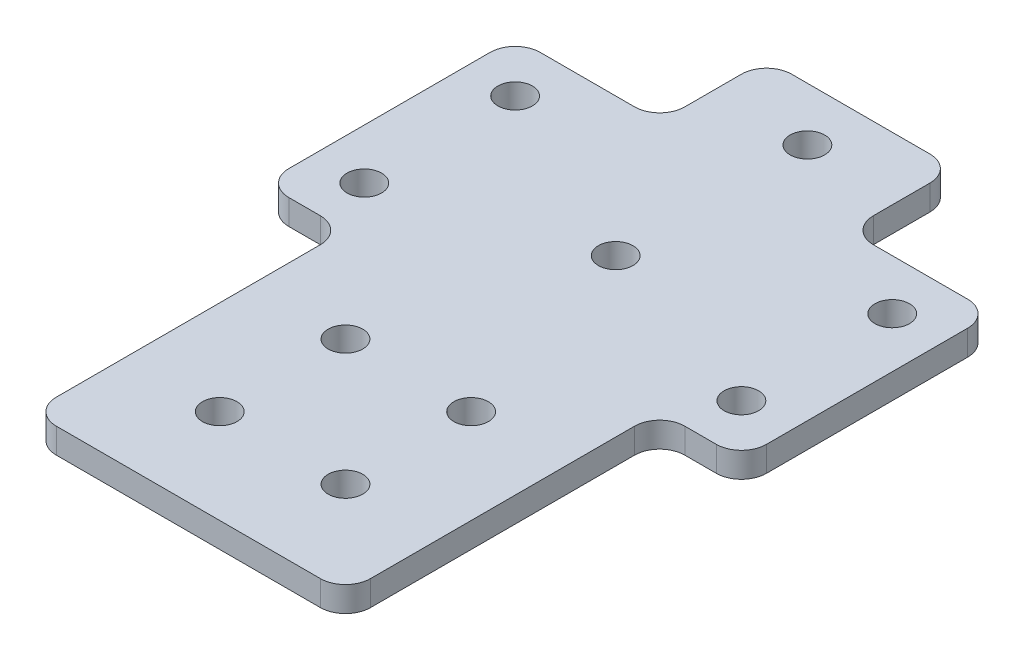
ISO-10303-21;
HEADER;
FILE_DESCRIPTION(('STEP AP214'),'2;1');
FILE_NAME('part.step','',(''),(''),'','','');
FILE_SCHEMA(('AUTOMOTIVE_DESIGN { 1 0 10303 214 1 1 1 1 }'));
ENDSEC;
DATA;
#1=APPLICATION_CONTEXT('core data for automotive mechanical design processes');
#2=APPLICATION_PROTOCOL_DEFINITION('international standard','automotive_design',2000,#1);
#3=PRODUCT_CONTEXT('',#1,'mechanical');
#4=PRODUCT('Part','Part','',(#3));
#5=PRODUCT_RELATED_PRODUCT_CATEGORY('part','',(#4));
#6=PRODUCT_DEFINITION_FORMATION('','',#4);
#7=PRODUCT_DEFINITION_CONTEXT('part definition',#1,'design');
#8=PRODUCT_DEFINITION('design','',#6,#7);
#9=PRODUCT_DEFINITION_SHAPE('','',#8);
#10=(LENGTH_UNIT() NAMED_UNIT(*) SI_UNIT(.MILLI.,.METRE.));
#11=(NAMED_UNIT(*) PLANE_ANGLE_UNIT() SI_UNIT($,.RADIAN.));
#12=(NAMED_UNIT(*) SI_UNIT($,.STERADIAN.) SOLID_ANGLE_UNIT());
#13=UNCERTAINTY_MEASURE_WITH_UNIT(LENGTH_MEASURE(1.E-05),#10,'distance_accuracy_value','');
#14=(GEOMETRIC_REPRESENTATION_CONTEXT(3) GLOBAL_UNCERTAINTY_ASSIGNED_CONTEXT((#13)) GLOBAL_UNIT_ASSIGNED_CONTEXT((#10,
#11,#12)) REPRESENTATION_CONTEXT('',''));
#15=CARTESIAN_POINT('',(0.,0.,0.));
#16=DIRECTION('',(0.,0.,1.));
#17=DIRECTION('',(1.,0.,0.));
#18=AXIS2_PLACEMENT_3D('',#15,#16,#17);
#19=CARTESIAN_POINT('',(-38.,4.,-15.));
#20=DIRECTION('',(0.,0.,1.));
#21=DIRECTION('',(1.,0.,0.));
#22=AXIS2_PLACEMENT_3D('',#19,#20,#21);
#23=PLANE('',#22);
#24=DIRECTION('',(-1.,0.,0.));
#25=VECTOR('',#24,1.);
#26=CARTESIAN_POINT('',(-38.,4.,-15.));
#27=LINE('',#26,#25);
#28=CARTESIAN_POINT('',(-19.,4.,-15.));
#29=VERTEX_POINT('',#28);
#30=CARTESIAN_POINT('',(-34.,4.,-15.));
#31=VERTEX_POINT('',#30);
#32=EDGE_CURVE('E294',#29,#31,#27,.T.);
#33=ORIENTED_EDGE('',*,*,#32,.F.);
#34=DIRECTION('',(0.,1.,0.));
#35=VECTOR('',#34,1.);
#36=CARTESIAN_POINT('',(-19.,4.,-15.));
#37=LINE('',#36,#35);
#38=CARTESIAN_POINT('',(-19.,0.,-15.));
#39=VERTEX_POINT('',#38);
#40=EDGE_CURVE('E329',#29,#39,#37,.F.);
#41=ORIENTED_EDGE('',*,*,#40,.T.);
#42=DIRECTION('',(-1.,0.,0.));
#43=VECTOR('',#42,1.);
#44=CARTESIAN_POINT('',(-38.,0.,-15.));
#45=LINE('',#44,#43);
#46=CARTESIAN_POINT('',(-34.,0.,-15.));
#47=VERTEX_POINT('',#46);
#48=EDGE_CURVE('E224',#39,#47,#45,.T.);
#49=ORIENTED_EDGE('',*,*,#48,.T.);
#50=DIRECTION('',(0.,-1.,0.));
#51=VECTOR('',#50,1.);
#52=CARTESIAN_POINT('',(-34.,4.,-15.));
#53=LINE('',#52,#51);
#54=EDGE_CURVE('E327',#47,#31,#53,.F.);
#55=ORIENTED_EDGE('',*,*,#54,.T.);
#56=EDGE_LOOP('',(#33,#41,#49,#55));
#57=FACE_BOUND('',#56,.T.);
#58=ADVANCED_FACE('F32',(#57),#23,.F.);
#59=CARTESIAN_POINT('',(-38.,4.,25.));
#60=DIRECTION('',(0.,0.,-1.));
#61=DIRECTION('',(-1.,0.,0.));
#62=AXIS2_PLACEMENT_3D('',#59,#60,#61);
#63=PLANE('',#62);
#64=DIRECTION('',(1.,0.,0.));
#65=VECTOR('',#64,1.);
#66=CARTESIAN_POINT('',(-38.,4.,25.));
#67=LINE('',#66,#65);
#68=CARTESIAN_POINT('',(29.,4.,25.));
#69=VERTEX_POINT('',#68);
#70=CARTESIAN_POINT('',(34.,4.,25.));
#71=VERTEX_POINT('',#70);
#72=EDGE_CURVE('E227',#69,#71,#67,.T.);
#73=ORIENTED_EDGE('',*,*,#72,.F.);
#74=DIRECTION('',(0.,1.,0.));
#75=VECTOR('',#74,1.);
#76=CARTESIAN_POINT('',(29.,4.,25.));
#77=LINE('',#76,#75);
#78=CARTESIAN_POINT('',(29.,0.,25.));
#79=VERTEX_POINT('',#78);
#80=EDGE_CURVE('E348',#69,#79,#77,.F.);
#81=ORIENTED_EDGE('',*,*,#80,.T.);
#82=DIRECTION('',(1.,0.,0.));
#83=VECTOR('',#82,1.);
#84=CARTESIAN_POINT('',(-38.,0.,25.));
#85=LINE('',#84,#83);
#86=CARTESIAN_POINT('',(34.,0.,25.));
#87=VERTEX_POINT('',#86);
#88=EDGE_CURVE('E254',#79,#87,#85,.T.);
#89=ORIENTED_EDGE('',*,*,#88,.T.);
#90=DIRECTION('',(0.,-1.,0.));
#91=VECTOR('',#90,1.);
#92=CARTESIAN_POINT('',(34.,4.,25.));
#93=LINE('',#92,#91);
#94=EDGE_CURVE('E346',#87,#71,#93,.F.);
#95=ORIENTED_EDGE('',*,*,#94,.T.);
#96=EDGE_LOOP('',(#73,#81,#89,#95));
#97=FACE_BOUND('',#96,.T.);
#98=ADVANCED_FACE('F481',(#97),#63,.F.);
#99=CARTESIAN_POINT('',(0.,4.,0.));
#100=DIRECTION('',(0.,1.,0.));
#101=DIRECTION('',(0.,0.,1.));
#102=AXIS2_PLACEMENT_3D('',#99,#100,#101);
#103=PLANE('',#102);
#104=CARTESIAN_POINT('',(10.,4.,60.));
#105=DIRECTION('',(0.,1.,0.));
#106=DIRECTION('',(0.,0.,1.));
#107=AXIS2_PLACEMENT_3D('',#104,#105,#106);
#108=CIRCLE('',#107,2.75);
#109=CARTESIAN_POINT('',(10.,4.,62.75));
#110=VERTEX_POINT('',#109);
#111=EDGE_CURVE('E848',#110,#110,#108,.T.);
#112=ORIENTED_EDGE('',*,*,#111,.F.);
#113=EDGE_LOOP('',(#112));
#114=FACE_BOUND('',#113,.T.);
#115=CARTESIAN_POINT('',(-9.99999999999999,4.,60.));
#116=DIRECTION('',(0.,1.,0.));
#117=DIRECTION('',(0.,0.,1.));
#118=AXIS2_PLACEMENT_3D('',#115,#116,#117);
#119=CIRCLE('',#118,2.75);
#120=CARTESIAN_POINT('',(-9.99999999999999,4.,62.75));
#121=VERTEX_POINT('',#120);
#122=EDGE_CURVE('E842',#121,#121,#119,.T.);
#123=ORIENTED_EDGE('',*,*,#122,.F.);
#124=EDGE_LOOP('',(#123));
#125=FACE_BOUND('',#124,.T.);
#126=CARTESIAN_POINT('',(10.,4.,40.));
#127=DIRECTION('',(0.,1.,0.));
#128=DIRECTION('',(0.,0.,1.));
#129=AXIS2_PLACEMENT_3D('',#126,#127,#128);
#130=CIRCLE('',#129,2.75);
#131=CARTESIAN_POINT('',(10.,4.,42.75));
#132=VERTEX_POINT('',#131);
#133=EDGE_CURVE('E836',#132,#132,#130,.T.);
#134=ORIENTED_EDGE('',*,*,#133,.F.);
#135=EDGE_LOOP('',(#134));
#136=FACE_BOUND('',#135,.T.);
#137=CARTESIAN_POINT('',(-9.99999999999999,4.,40.));
#138=DIRECTION('',(0.,1.,0.));
#139=DIRECTION('',(0.,0.,1.));
#140=AXIS2_PLACEMENT_3D('',#137,#138,#139);
#141=CIRCLE('',#140,2.75);
#142=CARTESIAN_POINT('',(-9.99999999999999,4.,42.75));
#143=VERTEX_POINT('',#142);
#144=EDGE_CURVE('E830',#143,#143,#141,.T.);
#145=ORIENTED_EDGE('',*,*,#144,.F.);
#146=EDGE_LOOP('',(#145));
#147=FACE_BOUND('',#146,.T.);
#148=CARTESIAN_POINT('',(0.,4.,7.));
#149=DIRECTION('',(0.,1.,0.));
#150=DIRECTION('',(0.,0.,1.));
#151=AXIS2_PLACEMENT_3D('',#148,#149,#150);
#152=CIRCLE('',#151,2.75);
#153=CARTESIAN_POINT('',(0.,4.,9.75));
#154=VERTEX_POINT('',#153);
#155=EDGE_CURVE('E824',#154,#154,#152,.T.);
#156=ORIENTED_EDGE('',*,*,#155,.F.);
#157=EDGE_LOOP('',(#156));
#158=FACE_BOUND('',#157,.T.);
#159=CARTESIAN_POINT('',(0.,4.,-23.5));
#160=DIRECTION('',(0.,1.,0.));
#161=DIRECTION('',(0.,0.,1.));
#162=AXIS2_PLACEMENT_3D('',#159,#160,#161);
#163=CIRCLE('',#162,2.75);
#164=CARTESIAN_POINT('',(0.,4.,-20.75));
#165=VERTEX_POINT('',#164);
#166=EDGE_CURVE('E819',#165,#165,#163,.T.);
#167=ORIENTED_EDGE('',*,*,#166,.F.);
#168=EDGE_LOOP('',(#167));
#169=FACE_BOUND('',#168,.T.);
#170=CARTESIAN_POINT('',(-30.,4.,17.));
#171=DIRECTION('',(0.,1.,0.));
#172=DIRECTION('',(0.,0.,1.));
#173=AXIS2_PLACEMENT_3D('',#170,#171,#172);
#174=CIRCLE('',#173,2.75);
#175=CARTESIAN_POINT('',(-30.,4.,19.75));
#176=VERTEX_POINT('',#175);
#177=EDGE_CURVE('E448',#176,#176,#174,.T.);
#178=ORIENTED_EDGE('',*,*,#177,.F.);
#179=EDGE_LOOP('',(#178));
#180=FACE_BOUND('',#179,.T.);
#181=CARTESIAN_POINT('',(-30.,4.,-7.));
#182=DIRECTION('',(0.,1.,0.));
#183=DIRECTION('',(0.,0.,1.));
#184=AXIS2_PLACEMENT_3D('',#181,#182,#183);
#185=CIRCLE('',#184,2.75);
#186=CARTESIAN_POINT('',(-30.,4.,-4.25));
#187=VERTEX_POINT('',#186);
#188=EDGE_CURVE('E303',#187,#187,#185,.T.);
#189=ORIENTED_EDGE('',*,*,#188,.F.);
#190=EDGE_LOOP('',(#189));
#191=FACE_BOUND('',#190,.T.);
#192=DIRECTION('',(0.,0.,-1.));
#193=VECTOR('',#192,1.);
#194=CARTESIAN_POINT('',(15.,4.,-15.));
#195=LINE('',#194,#193);
#196=CARTESIAN_POINT('',(15.,4.,-19.));
#197=VERTEX_POINT('',#196);
#198=CARTESIAN_POINT('',(15.,4.,-28.));
#199=VERTEX_POINT('',#198);
#200=EDGE_CURVE('E267',#197,#199,#195,.T.);
#201=ORIENTED_EDGE('',*,*,#200,.T.);
#202=CARTESIAN_POINT('',(11.,4.,-28.));
#203=DIRECTION('',(0.,1.,0.));
#204=DIRECTION('',(0.,0.,1.));
#205=AXIS2_PLACEMENT_3D('',#202,#203,#204);
#206=CIRCLE('',#205,4.);
#207=CARTESIAN_POINT('',(11.,4.,-32.));
#208=VERTEX_POINT('',#207);
#209=EDGE_CURVE('E411',#199,#208,#206,.T.);
#210=ORIENTED_EDGE('',*,*,#209,.T.);
#211=DIRECTION('',(-1.,0.,0.));
#212=VECTOR('',#211,1.);
#213=CARTESIAN_POINT('',(-15.,4.,-32.));
#214=LINE('',#213,#212);
#215=CARTESIAN_POINT('',(-11.,4.,-32.));
#216=VERTEX_POINT('',#215);
#217=EDGE_CURVE('E253',#208,#216,#214,.T.);
#218=ORIENTED_EDGE('',*,*,#217,.T.);
#219=CARTESIAN_POINT('',(-11.,4.,-28.));
#220=DIRECTION('',(0.,1.,0.));
#221=DIRECTION('',(0.,0.,1.));
#222=AXIS2_PLACEMENT_3D('',#219,#220,#221);
#223=CIRCLE('',#222,4.);
#224=CARTESIAN_POINT('',(-15.,4.,-28.));
#225=VERTEX_POINT('',#224);
#226=EDGE_CURVE('E409',#216,#225,#223,.T.);
#227=ORIENTED_EDGE('',*,*,#226,.T.);
#228=DIRECTION('',(0.,0.,1.));
#229=VECTOR('',#228,1.);
#230=CARTESIAN_POINT('',(-15.,4.,-15.));
#231=LINE('',#230,#229);
#232=CARTESIAN_POINT('',(-15.,4.,-19.));
#233=VERTEX_POINT('',#232);
#234=EDGE_CURVE('E290',#225,#233,#231,.T.);
#235=ORIENTED_EDGE('',*,*,#234,.T.);
#236=CARTESIAN_POINT('',(-19.,4.,-19.));
#237=DIRECTION('',(0.,1.,0.));
#238=DIRECTION('',(0.,0.,1.));
#239=AXIS2_PLACEMENT_3D('',#236,#237,#238);
#240=CIRCLE('',#239,4.);
#241=EDGE_CURVE('E367',#233,#29,#240,.F.);
#242=ORIENTED_EDGE('',*,*,#241,.T.);
#243=ORIENTED_EDGE('',*,*,#32,.T.);
#244=CARTESIAN_POINT('',(-34.,4.,-11.));
#245=DIRECTION('',(0.,1.,0.));
#246=DIRECTION('',(0.,0.,1.));
#247=AXIS2_PLACEMENT_3D('',#244,#245,#246);
#248=CIRCLE('',#247,4.);
#249=CARTESIAN_POINT('',(-38.,4.,-11.));
#250=VERTEX_POINT('',#249);
#251=EDGE_CURVE('E398',#31,#250,#248,.T.);
#252=ORIENTED_EDGE('',*,*,#251,.T.);
#253=DIRECTION('',(0.,0.,1.));
#254=VECTOR('',#253,1.);
#255=CARTESIAN_POINT('',(-38.,4.,-15.));
#256=LINE('',#255,#254);
#257=CARTESIAN_POINT('',(-38.,4.,21.));
#258=VERTEX_POINT('',#257);
#259=EDGE_CURVE('E223',#250,#258,#256,.T.);
#260=ORIENTED_EDGE('',*,*,#259,.T.);
#261=CARTESIAN_POINT('',(-34.,4.,21.));
#262=DIRECTION('',(0.,1.,0.));
#263=DIRECTION('',(0.,0.,1.));
#264=AXIS2_PLACEMENT_3D('',#261,#262,#263);
#265=CIRCLE('',#264,4.);
#266=CARTESIAN_POINT('',(-34.,4.,25.));
#267=VERTEX_POINT('',#266);
#268=EDGE_CURVE('E274',#258,#267,#265,.T.);
#269=ORIENTED_EDGE('',*,*,#268,.T.);
#270=CARTESIAN_POINT('',(-29.,4.,25.));
#271=VERTEX_POINT('',#270);
#272=EDGE_CURVE('E275',#267,#271,#67,.T.);
#273=ORIENTED_EDGE('',*,*,#272,.T.);
#274=CARTESIAN_POINT('',(-29.,4.,29.));
#275=DIRECTION('',(0.,1.,0.));
#276=DIRECTION('',(0.,0.,1.));
#277=AXIS2_PLACEMENT_3D('',#274,#275,#276);
#278=CIRCLE('',#277,4.);
#279=CARTESIAN_POINT('',(-25.,4.,29.));
#280=VERTEX_POINT('',#279);
#281=EDGE_CURVE('E40',#271,#280,#278,.F.);
#282=ORIENTED_EDGE('',*,*,#281,.T.);
#283=DIRECTION('',(0.,0.,1.));
#284=VECTOR('',#283,1.);
#285=CARTESIAN_POINT('',(-25.,4.,25.));
#286=LINE('',#285,#284);
#287=CARTESIAN_POINT('',(-25.,4.,71.));
#288=VERTEX_POINT('',#287);
#289=EDGE_CURVE('E280',#280,#288,#286,.T.);
#290=ORIENTED_EDGE('',*,*,#289,.T.);
#291=CARTESIAN_POINT('',(-21.,4.,71.));
#292=DIRECTION('',(0.,1.,0.));
#293=DIRECTION('',(0.,0.,1.));
#294=AXIS2_PLACEMENT_3D('',#291,#292,#293);
#295=CIRCLE('',#294,4.);
#296=CARTESIAN_POINT('',(-21.,4.,75.));
#297=VERTEX_POINT('',#296);
#298=EDGE_CURVE('E407',#288,#297,#295,.T.);
#299=ORIENTED_EDGE('',*,*,#298,.T.);
#300=DIRECTION('',(1.,0.,0.));
#301=VECTOR('',#300,1.);
#302=CARTESIAN_POINT('',(-25.,4.,75.));
#303=LINE('',#302,#301);
#304=CARTESIAN_POINT('',(21.,4.,75.));
#305=VERTEX_POINT('',#304);
#306=EDGE_CURVE('E388',#297,#305,#303,.T.);
#307=ORIENTED_EDGE('',*,*,#306,.T.);
#308=CARTESIAN_POINT('',(21.,4.,71.));
#309=DIRECTION('',(0.,1.,0.));
#310=DIRECTION('',(0.,0.,1.));
#311=AXIS2_PLACEMENT_3D('',#308,#309,#310);
#312=CIRCLE('',#311,4.);
#313=CARTESIAN_POINT('',(25.,4.,71.));
#314=VERTEX_POINT('',#313);
#315=EDGE_CURVE('E405',#305,#314,#312,.T.);
#316=ORIENTED_EDGE('',*,*,#315,.T.);
#317=DIRECTION('',(0.,0.,-1.));
#318=VECTOR('',#317,1.);
#319=CARTESIAN_POINT('',(25.,4.,25.));
#320=LINE('',#319,#318);
#321=CARTESIAN_POINT('',(25.,4.,29.));
#322=VERTEX_POINT('',#321);
#323=EDGE_CURVE('E289',#314,#322,#320,.T.);
#324=ORIENTED_EDGE('',*,*,#323,.T.);
#325=CARTESIAN_POINT('',(29.,4.,29.));
#326=DIRECTION('',(0.,1.,0.));
#327=DIRECTION('',(0.,0.,1.));
#328=AXIS2_PLACEMENT_3D('',#325,#326,#327);
#329=CIRCLE('',#328,4.);
#330=EDGE_CURVE('E371',#322,#69,#329,.F.);
#331=ORIENTED_EDGE('',*,*,#330,.T.);
#332=ORIENTED_EDGE('',*,*,#72,.T.);
#333=CARTESIAN_POINT('',(34.,4.,21.));
#334=DIRECTION('',(0.,1.,0.));
#335=DIRECTION('',(0.,0.,1.));
#336=AXIS2_PLACEMENT_3D('',#333,#334,#335);
#337=CIRCLE('',#336,4.);
#338=CARTESIAN_POINT('',(38.,4.,21.));
#339=VERTEX_POINT('',#338);
#340=EDGE_CURVE('E401',#71,#339,#337,.T.);
#341=ORIENTED_EDGE('',*,*,#340,.T.);
#342=DIRECTION('',(0.,0.,-1.));
#343=VECTOR('',#342,1.);
#344=CARTESIAN_POINT('',(38.,4.,-15.));
#345=LINE('',#344,#343);
#346=CARTESIAN_POINT('',(38.,4.,-11.));
#347=VERTEX_POINT('',#346);
#348=EDGE_CURVE('E279',#339,#347,#345,.T.);
#349=ORIENTED_EDGE('',*,*,#348,.T.);
#350=CARTESIAN_POINT('',(34.,4.,-11.));
#351=DIRECTION('',(0.,1.,0.));
#352=DIRECTION('',(0.,0.,1.));
#353=AXIS2_PLACEMENT_3D('',#350,#351,#352);
#354=CIRCLE('',#353,4.);
#355=CARTESIAN_POINT('',(34.,4.,-15.));
#356=VERTEX_POINT('',#355);
#357=EDGE_CURVE('E399',#347,#356,#354,.T.);
#358=ORIENTED_EDGE('',*,*,#357,.T.);
#359=CARTESIAN_POINT('',(19.,4.,-15.));
#360=VERTEX_POINT('',#359);
#361=EDGE_CURVE('E214',#356,#360,#27,.T.);
#362=ORIENTED_EDGE('',*,*,#361,.T.);
#363=CARTESIAN_POINT('',(19.,4.,-19.));
#364=DIRECTION('',(0.,1.,0.));
#365=DIRECTION('',(0.,0.,1.));
#366=AXIS2_PLACEMENT_3D('',#363,#364,#365);
#367=CIRCLE('',#366,4.);
#368=EDGE_CURVE('E364',#360,#197,#367,.F.);
#369=ORIENTED_EDGE('',*,*,#368,.T.);
#370=EDGE_LOOP('',(#201,#210,#218,#227,#235,#242,#243,#252,#260,#269,#273,#282,#290,#299,#307,
#316,#324,#331,#332,#341,#349,#358,#362,#369));
#371=FACE_BOUND('',#370,.T.);
#372=CARTESIAN_POINT('',(30.,4.,-7.));
#373=DIRECTION('',(0.,1.,0.));
#374=DIRECTION('',(0.,0.,1.));
#375=AXIS2_PLACEMENT_3D('',#372,#373,#374);
#376=CIRCLE('',#375,2.75);
#377=CARTESIAN_POINT('',(30.,4.,-4.25));
#378=VERTEX_POINT('',#377);
#379=EDGE_CURVE('E454',#378,#378,#376,.T.);
#380=ORIENTED_EDGE('',*,*,#379,.F.);
#381=EDGE_LOOP('',(#380));
#382=FACE_BOUND('',#381,.T.);
#383=CARTESIAN_POINT('',(30.,4.,17.));
#384=DIRECTION('',(0.,1.,0.));
#385=DIRECTION('',(0.,0.,1.));
#386=AXIS2_PLACEMENT_3D('',#383,#384,#385);
#387=CIRCLE('',#386,2.75);
#388=CARTESIAN_POINT('',(30.,4.,19.75));
#389=VERTEX_POINT('',#388);
#390=EDGE_CURVE('E441',#389,#389,#387,.T.);
#391=ORIENTED_EDGE('',*,*,#390,.F.);
#392=EDGE_LOOP('',(#391));
#393=FACE_BOUND('',#392,.T.);
#394=ADVANCED_FACE('F378',(#114,#125,#136,#147,#158,#169,#180,#191,#371,#382,#393),#103,.T.);
#395=CARTESIAN_POINT('',(0.,0.,0.));
#396=DIRECTION('',(0.,1.,0.));
#397=DIRECTION('',(0.,0.,1.));
#398=AXIS2_PLACEMENT_3D('',#395,#396,#397);
#399=PLANE('',#398);
#400=CARTESIAN_POINT('',(10.,0.,60.));
#401=DIRECTION('',(0.,1.,0.));
#402=DIRECTION('',(0.,0.,1.));
#403=AXIS2_PLACEMENT_3D('',#400,#401,#402);
#404=CIRCLE('',#403,2.75);
#405=CARTESIAN_POINT('',(10.,0.,62.75));
#406=VERTEX_POINT('',#405);
#407=EDGE_CURVE('E845',#406,#406,#404,.T.);
#408=ORIENTED_EDGE('',*,*,#407,.T.);
#409=EDGE_LOOP('',(#408));
#410=FACE_BOUND('',#409,.T.);
#411=CARTESIAN_POINT('',(-9.99999999999999,0.,60.));
#412=DIRECTION('',(0.,1.,0.));
#413=DIRECTION('',(0.,0.,1.));
#414=AXIS2_PLACEMENT_3D('',#411,#412,#413);
#415=CIRCLE('',#414,2.75);
#416=CARTESIAN_POINT('',(-9.99999999999999,0.,62.75));
#417=VERTEX_POINT('',#416);
#418=EDGE_CURVE('E839',#417,#417,#415,.T.);
#419=ORIENTED_EDGE('',*,*,#418,.T.);
#420=EDGE_LOOP('',(#419));
#421=FACE_BOUND('',#420,.T.);
#422=CARTESIAN_POINT('',(10.,0.,40.));
#423=DIRECTION('',(0.,1.,0.));
#424=DIRECTION('',(0.,0.,1.));
#425=AXIS2_PLACEMENT_3D('',#422,#423,#424);
#426=CIRCLE('',#425,2.75);
#427=CARTESIAN_POINT('',(10.,0.,42.75));
#428=VERTEX_POINT('',#427);
#429=EDGE_CURVE('E833',#428,#428,#426,.T.);
#430=ORIENTED_EDGE('',*,*,#429,.T.);
#431=EDGE_LOOP('',(#430));
#432=FACE_BOUND('',#431,.T.);
#433=CARTESIAN_POINT('',(-9.99999999999999,0.,40.));
#434=DIRECTION('',(0.,1.,0.));
#435=DIRECTION('',(0.,0.,1.));
#436=AXIS2_PLACEMENT_3D('',#433,#434,#435);
#437=CIRCLE('',#436,2.75);
#438=CARTESIAN_POINT('',(-9.99999999999999,0.,42.75));
#439=VERTEX_POINT('',#438);
#440=EDGE_CURVE('E828',#439,#439,#437,.T.);
#441=ORIENTED_EDGE('',*,*,#440,.T.);
#442=EDGE_LOOP('',(#441));
#443=FACE_BOUND('',#442,.T.);
#444=CARTESIAN_POINT('',(0.,0.,7.));
#445=DIRECTION('',(0.,1.,0.));
#446=DIRECTION('',(0.,0.,1.));
#447=AXIS2_PLACEMENT_3D('',#444,#445,#446);
#448=CIRCLE('',#447,2.75);
#449=CARTESIAN_POINT('',(0.,0.,9.75));
#450=VERTEX_POINT('',#449);
#451=EDGE_CURVE('E821',#450,#450,#448,.T.);
#452=ORIENTED_EDGE('',*,*,#451,.T.);
#453=EDGE_LOOP('',(#452));
#454=FACE_BOUND('',#453,.T.);
#455=CARTESIAN_POINT('',(0.,0.,-23.5));
#456=DIRECTION('',(0.,1.,0.));
#457=DIRECTION('',(0.,0.,1.));
#458=AXIS2_PLACEMENT_3D('',#455,#456,#457);
#459=CIRCLE('',#458,2.75);
#460=CARTESIAN_POINT('',(0.,0.,-20.75));
#461=VERTEX_POINT('',#460);
#462=EDGE_CURVE('E293',#461,#461,#459,.T.);
#463=ORIENTED_EDGE('',*,*,#462,.T.);
#464=EDGE_LOOP('',(#463));
#465=FACE_BOUND('',#464,.T.);
#466=DIRECTION('',(-1.,0.,0.));
#467=VECTOR('',#466,1.);
#468=CARTESIAN_POINT('',(-15.,0.,-32.));
#469=LINE('',#468,#467);
#470=CARTESIAN_POINT('',(11.,0.,-32.));
#471=VERTEX_POINT('',#470);
#472=CARTESIAN_POINT('',(-11.,0.,-32.));
#473=VERTEX_POINT('',#472);
#474=EDGE_CURVE('E266',#471,#473,#469,.T.);
#475=ORIENTED_EDGE('',*,*,#474,.F.);
#476=CARTESIAN_POINT('',(11.,0.,-28.));
#477=DIRECTION('',(0.,1.,0.));
#478=DIRECTION('',(0.,0.,1.));
#479=AXIS2_PLACEMENT_3D('',#476,#477,#478);
#480=CIRCLE('',#479,4.);
#481=CARTESIAN_POINT('',(15.,0.,-28.));
#482=VERTEX_POINT('',#481);
#483=EDGE_CURVE('E320',#471,#482,#480,.F.);
#484=ORIENTED_EDGE('',*,*,#483,.T.);
#485=DIRECTION('',(0.,0.,-1.));
#486=VECTOR('',#485,1.);
#487=CARTESIAN_POINT('',(15.,0.,-15.));
#488=LINE('',#487,#486);
#489=CARTESIAN_POINT('',(15.,0.,-19.));
#490=VERTEX_POINT('',#489);
#491=EDGE_CURVE('E252',#490,#482,#488,.T.);
#492=ORIENTED_EDGE('',*,*,#491,.F.);
#493=CARTESIAN_POINT('',(19.,0.,-19.));
#494=DIRECTION('',(0.,1.,0.));
#495=DIRECTION('',(0.,0.,1.));
#496=AXIS2_PLACEMENT_3D('',#493,#494,#495);
#497=CIRCLE('',#496,4.);
#498=CARTESIAN_POINT('',(19.,0.,-15.));
#499=VERTEX_POINT('',#498);
#500=EDGE_CURVE('E222',#490,#499,#497,.T.);
#501=ORIENTED_EDGE('',*,*,#500,.T.);
#502=CARTESIAN_POINT('',(34.,0.,-15.));
#503=VERTEX_POINT('',#502);
#504=EDGE_CURVE('E211',#503,#499,#45,.T.);
#505=ORIENTED_EDGE('',*,*,#504,.F.);
#506=CARTESIAN_POINT('',(34.,0.,-11.));
#507=DIRECTION('',(0.,1.,0.));
#508=DIRECTION('',(0.,0.,1.));
#509=AXIS2_PLACEMENT_3D('',#506,#507,#508);
#510=CIRCLE('',#509,4.);
#511=CARTESIAN_POINT('',(38.,0.,-11.));
#512=VERTEX_POINT('',#511);
#513=EDGE_CURVE('E194',#503,#512,#510,.F.);
#514=ORIENTED_EDGE('',*,*,#513,.T.);
#515=DIRECTION('',(0.,0.,-1.));
#516=VECTOR('',#515,1.);
#517=CARTESIAN_POINT('',(38.,0.,-15.));
#518=LINE('',#517,#516);
#519=CARTESIAN_POINT('',(38.,0.,21.));
#520=VERTEX_POINT('',#519);
#521=EDGE_CURVE('E230',#520,#512,#518,.T.);
#522=ORIENTED_EDGE('',*,*,#521,.F.);
#523=CARTESIAN_POINT('',(34.,0.,21.));
#524=DIRECTION('',(0.,1.,0.));
#525=DIRECTION('',(0.,0.,1.));
#526=AXIS2_PLACEMENT_3D('',#523,#524,#525);
#527=CIRCLE('',#526,4.);
#528=EDGE_CURVE('E203',#520,#87,#527,.F.);
#529=ORIENTED_EDGE('',*,*,#528,.T.);
#530=ORIENTED_EDGE('',*,*,#88,.F.);
#531=CARTESIAN_POINT('',(29.,0.,29.));
#532=DIRECTION('',(0.,1.,0.));
#533=DIRECTION('',(0.,0.,1.));
#534=AXIS2_PLACEMENT_3D('',#531,#532,#533);
#535=CIRCLE('',#534,4.);
#536=CARTESIAN_POINT('',(25.,0.,29.));
#537=VERTEX_POINT('',#536);
#538=EDGE_CURVE('E373',#79,#537,#535,.T.);
#539=ORIENTED_EDGE('',*,*,#538,.T.);
#540=DIRECTION('',(0.,0.,-1.));
#541=VECTOR('',#540,1.);
#542=CARTESIAN_POINT('',(25.,0.,25.));
#543=LINE('',#542,#541);
#544=CARTESIAN_POINT('',(25.,0.,71.));
#545=VERTEX_POINT('',#544);
#546=EDGE_CURVE('E438',#545,#537,#543,.T.);
#547=ORIENTED_EDGE('',*,*,#546,.F.);
#548=CARTESIAN_POINT('',(21.,0.,71.));
#549=DIRECTION('',(0.,1.,0.));
#550=DIRECTION('',(0.,0.,1.));
#551=AXIS2_PLACEMENT_3D('',#548,#549,#550);
#552=CIRCLE('',#551,4.);
#553=CARTESIAN_POINT('',(21.,0.,75.));
#554=VERTEX_POINT('',#553);
#555=EDGE_CURVE('E314',#545,#554,#552,.F.);
#556=ORIENTED_EDGE('',*,*,#555,.T.);
#557=DIRECTION('',(1.,0.,0.));
#558=VECTOR('',#557,1.);
#559=CARTESIAN_POINT('',(-25.,0.,75.));
#560=LINE('',#559,#558);
#561=CARTESIAN_POINT('',(-21.,0.,75.));
#562=VERTEX_POINT('',#561);
#563=EDGE_CURVE('E435',#562,#554,#560,.T.);
#564=ORIENTED_EDGE('',*,*,#563,.F.);
#565=CARTESIAN_POINT('',(-21.,0.,71.));
#566=DIRECTION('',(0.,1.,0.));
#567=DIRECTION('',(0.,0.,1.));
#568=AXIS2_PLACEMENT_3D('',#565,#566,#567);
#569=CIRCLE('',#568,4.);
#570=CARTESIAN_POINT('',(-25.,0.,71.));
#571=VERTEX_POINT('',#570);
#572=EDGE_CURVE('E316',#562,#571,#569,.F.);
#573=ORIENTED_EDGE('',*,*,#572,.T.);
#574=DIRECTION('',(0.,0.,1.));
#575=VECTOR('',#574,1.);
#576=CARTESIAN_POINT('',(-25.,0.,25.));
#577=LINE('',#576,#575);
#578=CARTESIAN_POINT('',(-25.,0.,29.));
#579=VERTEX_POINT('',#578);
#580=EDGE_CURVE('E310',#579,#571,#577,.T.);
#581=ORIENTED_EDGE('',*,*,#580,.F.);
#582=CARTESIAN_POINT('',(-29.,0.,29.));
#583=DIRECTION('',(0.,1.,0.));
#584=DIRECTION('',(0.,0.,1.));
#585=AXIS2_PLACEMENT_3D('',#582,#583,#584);
#586=CIRCLE('',#585,4.);
#587=CARTESIAN_POINT('',(-29.,0.,25.));
#588=VERTEX_POINT('',#587);
#589=EDGE_CURVE('E11',#579,#588,#586,.T.);
#590=ORIENTED_EDGE('',*,*,#589,.T.);
#591=CARTESIAN_POINT('',(-34.,0.,25.));
#592=VERTEX_POINT('',#591);
#593=EDGE_CURVE('E307',#592,#588,#85,.T.);
#594=ORIENTED_EDGE('',*,*,#593,.F.);
#595=CARTESIAN_POINT('',(-34.,0.,21.));
#596=DIRECTION('',(0.,1.,0.));
#597=DIRECTION('',(0.,0.,1.));
#598=AXIS2_PLACEMENT_3D('',#595,#596,#597);
#599=CIRCLE('',#598,4.);
#600=CARTESIAN_POINT('',(-38.,0.,21.));
#601=VERTEX_POINT('',#600);
#602=EDGE_CURVE('E53',#592,#601,#599,.F.);
#603=ORIENTED_EDGE('',*,*,#602,.T.);
#604=DIRECTION('',(0.,0.,1.));
#605=VECTOR('',#604,1.);
#606=CARTESIAN_POINT('',(-38.,0.,-15.));
#607=LINE('',#606,#605);
#608=CARTESIAN_POINT('',(-38.,0.,-11.));
#609=VERTEX_POINT('',#608);
#610=EDGE_CURVE('E300',#609,#601,#607,.T.);
#611=ORIENTED_EDGE('',*,*,#610,.F.);
#612=CARTESIAN_POINT('',(-34.,0.,-11.));
#613=DIRECTION('',(0.,1.,0.));
#614=DIRECTION('',(0.,0.,1.));
#615=AXIS2_PLACEMENT_3D('',#612,#613,#614);
#616=CIRCLE('',#615,4.);
#617=EDGE_CURVE('E204',#609,#47,#616,.F.);
#618=ORIENTED_EDGE('',*,*,#617,.T.);
#619=ORIENTED_EDGE('',*,*,#48,.F.);
#620=CARTESIAN_POINT('',(-19.,0.,-19.));
#621=DIRECTION('',(0.,1.,0.));
#622=DIRECTION('',(0.,0.,1.));
#623=AXIS2_PLACEMENT_3D('',#620,#621,#622);
#624=CIRCLE('',#623,4.);
#625=CARTESIAN_POINT('',(-15.,0.,-19.));
#626=VERTEX_POINT('',#625);
#627=EDGE_CURVE('E369',#39,#626,#624,.T.);
#628=ORIENTED_EDGE('',*,*,#627,.T.);
#629=DIRECTION('',(0.,0.,1.));
#630=VECTOR('',#629,1.);
#631=CARTESIAN_POINT('',(-15.,0.,-15.));
#632=LINE('',#631,#630);
#633=CARTESIAN_POINT('',(-15.,0.,-28.));
#634=VERTEX_POINT('',#633);
#635=EDGE_CURVE('E249',#634,#626,#632,.T.);
#636=ORIENTED_EDGE('',*,*,#635,.F.);
#637=CARTESIAN_POINT('',(-11.,0.,-28.));
#638=DIRECTION('',(0.,1.,0.));
#639=DIRECTION('',(0.,0.,1.));
#640=AXIS2_PLACEMENT_3D('',#637,#638,#639);
#641=CIRCLE('',#640,4.);
#642=EDGE_CURVE('E318',#634,#473,#641,.F.);
#643=ORIENTED_EDGE('',*,*,#642,.T.);
#644=EDGE_LOOP('',(#475,#484,#492,#501,#505,#514,#522,#529,#530,#539,#547,#556,#564,#573,#581,
#590,#594,#603,#611,#618,#619,#628,#636,#643));
#645=FACE_BOUND('',#644,.T.);
#646=CARTESIAN_POINT('',(-30.,0.,-7.));
#647=DIRECTION('',(0.,1.,0.));
#648=DIRECTION('',(0.,0.,1.));
#649=AXIS2_PLACEMENT_3D('',#646,#647,#648);
#650=CIRCLE('',#649,2.75);
#651=CARTESIAN_POINT('',(-30.,0.,-4.25));
#652=VERTEX_POINT('',#651);
#653=EDGE_CURVE('E457',#652,#652,#650,.T.);
#654=ORIENTED_EDGE('',*,*,#653,.T.);
#655=EDGE_LOOP('',(#654));
#656=FACE_BOUND('',#655,.T.);
#657=CARTESIAN_POINT('',(30.,0.,-7.));
#658=DIRECTION('',(0.,1.,0.));
#659=DIRECTION('',(0.,0.,1.));
#660=AXIS2_PLACEMENT_3D('',#657,#658,#659);
#661=CIRCLE('',#660,2.75);
#662=CARTESIAN_POINT('',(30.,0.,-4.25));
#663=VERTEX_POINT('',#662);
#664=EDGE_CURVE('E451',#663,#663,#661,.T.);
#665=ORIENTED_EDGE('',*,*,#664,.T.);
#666=EDGE_LOOP('',(#665));
#667=FACE_BOUND('',#666,.T.);
#668=CARTESIAN_POINT('',(-30.,0.,17.));
#669=DIRECTION('',(0.,1.,0.));
#670=DIRECTION('',(0.,0.,1.));
#671=AXIS2_PLACEMENT_3D('',#668,#669,#670);
#672=CIRCLE('',#671,2.75);
#673=CARTESIAN_POINT('',(-30.,0.,19.75));
#674=VERTEX_POINT('',#673);
#675=EDGE_CURVE('E444',#674,#674,#672,.T.);
#676=ORIENTED_EDGE('',*,*,#675,.T.);
#677=EDGE_LOOP('',(#676));
#678=FACE_BOUND('',#677,.T.);
#679=CARTESIAN_POINT('',(30.,0.,17.));
#680=DIRECTION('',(0.,1.,0.));
#681=DIRECTION('',(0.,0.,1.));
#682=AXIS2_PLACEMENT_3D('',#679,#680,#681);
#683=CIRCLE('',#682,2.75);
#684=CARTESIAN_POINT('',(30.,0.,19.75));
#685=VERTEX_POINT('',#684);
#686=EDGE_CURVE('E445',#685,#685,#683,.T.);
#687=ORIENTED_EDGE('',*,*,#686,.T.);
#688=EDGE_LOOP('',(#687));
#689=FACE_BOUND('',#688,.T.);
#690=ADVANCED_FACE('F218',(#410,#421,#432,#443,#454,#465,#645,#656,#667,#678,#689),#399,.F.);
#691=CARTESIAN_POINT('',(-38.,4.,-15.));
#692=DIRECTION('',(1.,0.,0.));
#693=DIRECTION('',(0.,0.,-1.));
#694=AXIS2_PLACEMENT_3D('',#691,#692,#693);
#695=PLANE('',#694);
#696=ORIENTED_EDGE('',*,*,#259,.F.);
#697=DIRECTION('',(0.,-1.,0.));
#698=VECTOR('',#697,1.);
#699=CARTESIAN_POINT('',(-38.,4.,-11.));
#700=LINE('',#699,#698);
#701=EDGE_CURVE('E356',#250,#609,#700,.T.);
#702=ORIENTED_EDGE('',*,*,#701,.T.);
#703=ORIENTED_EDGE('',*,*,#610,.T.);
#704=DIRECTION('',(0.,-1.,0.));
#705=VECTOR('',#704,1.);
#706=CARTESIAN_POINT('',(-38.,4.,21.));
#707=LINE('',#706,#705);
#708=EDGE_CURVE('E354',#601,#258,#707,.F.);
#709=ORIENTED_EDGE('',*,*,#708,.T.);
#710=EDGE_LOOP('',(#696,#702,#703,#709));
#711=FACE_BOUND('',#710,.T.);
#712=ADVANCED_FACE('F394',(#711),#695,.F.);
#713=ORIENTED_EDGE('',*,*,#272,.F.);
#714=DIRECTION('',(0.,-1.,0.));
#715=VECTOR('',#714,1.);
#716=CARTESIAN_POINT('',(-34.,4.,25.));
#717=LINE('',#716,#715);
#718=EDGE_CURVE('E362',#267,#592,#717,.T.);
#719=ORIENTED_EDGE('',*,*,#718,.T.);
#720=ORIENTED_EDGE('',*,*,#593,.T.);
#721=DIRECTION('',(0.,1.,0.));
#722=VECTOR('',#721,1.);
#723=CARTESIAN_POINT('',(-29.,4.,25.));
#724=LINE('',#723,#722);
#725=EDGE_CURVE('E359',#588,#271,#724,.T.);
#726=ORIENTED_EDGE('',*,*,#725,.T.);
#727=EDGE_LOOP('',(#713,#719,#720,#726));
#728=FACE_BOUND('',#727,.T.);
#729=ADVANCED_FACE('F390',(#728),#63,.F.);
#730=CARTESIAN_POINT('',(38.,4.,-15.));
#731=DIRECTION('',(-1.,0.,0.));
#732=DIRECTION('',(0.,0.,1.));
#733=AXIS2_PLACEMENT_3D('',#730,#731,#732);
#734=PLANE('',#733);
#735=ORIENTED_EDGE('',*,*,#348,.F.);
#736=DIRECTION('',(0.,-1.,0.));
#737=VECTOR('',#736,1.);
#738=CARTESIAN_POINT('',(38.,4.,21.));
#739=LINE('',#738,#737);
#740=EDGE_CURVE('E351',#339,#520,#739,.T.);
#741=ORIENTED_EDGE('',*,*,#740,.T.);
#742=ORIENTED_EDGE('',*,*,#521,.T.);
#743=DIRECTION('',(0.,-1.,0.));
#744=VECTOR('',#743,1.);
#745=CARTESIAN_POINT('',(38.,4.,-11.));
#746=LINE('',#745,#744);
#747=EDGE_CURVE('E199',#512,#347,#746,.F.);
#748=ORIENTED_EDGE('',*,*,#747,.T.);
#749=EDGE_LOOP('',(#735,#741,#742,#748));
#750=FACE_BOUND('',#749,.T.);
#751=ADVANCED_FACE('F477',(#750),#734,.F.);
#752=ORIENTED_EDGE('',*,*,#504,.T.);
#753=DIRECTION('',(0.,1.,0.));
#754=VECTOR('',#753,1.);
#755=CARTESIAN_POINT('',(19.,4.,-15.));
#756=LINE('',#755,#754);
#757=EDGE_CURVE('E215',#499,#360,#756,.T.);
#758=ORIENTED_EDGE('',*,*,#757,.T.);
#759=ORIENTED_EDGE('',*,*,#361,.F.);
#760=DIRECTION('',(0.,-1.,0.));
#761=VECTOR('',#760,1.);
#762=CARTESIAN_POINT('',(34.,4.,-15.));
#763=LINE('',#762,#761);
#764=EDGE_CURVE('E198',#356,#503,#763,.T.);
#765=ORIENTED_EDGE('',*,*,#764,.T.);
#766=EDGE_LOOP('',(#752,#758,#759,#765));
#767=FACE_BOUND('',#766,.T.);
#768=ADVANCED_FACE('F209',(#767),#23,.F.);
#769=CARTESIAN_POINT('',(-30.,4.,-7.));
#770=DIRECTION('',(0.,-1.,0.));
#771=DIRECTION('',(0.,0.,-1.));
#772=AXIS2_PLACEMENT_3D('',#769,#770,#771);
#773=CYLINDRICAL_SURFACE('',#772,2.75);
#774=ORIENTED_EDGE('',*,*,#188,.T.);
#775=EDGE_LOOP('',(#774));
#776=FACE_BOUND('',#775,.T.);
#777=ORIENTED_EDGE('',*,*,#653,.F.);
#778=EDGE_LOOP('',(#777));
#779=FACE_BOUND('',#778,.T.);
#780=ADVANCED_FACE('F465',(#776,#779),#773,.F.);
#781=CARTESIAN_POINT('',(30.,4.,-7.));
#782=DIRECTION('',(0.,-1.,0.));
#783=DIRECTION('',(0.,0.,-1.));
#784=AXIS2_PLACEMENT_3D('',#781,#782,#783);
#785=CYLINDRICAL_SURFACE('',#784,2.75);
#786=ORIENTED_EDGE('',*,*,#379,.T.);
#787=EDGE_LOOP('',(#786));
#788=FACE_BOUND('',#787,.T.);
#789=ORIENTED_EDGE('',*,*,#664,.F.);
#790=EDGE_LOOP('',(#789));
#791=FACE_BOUND('',#790,.T.);
#792=ADVANCED_FACE('F467',(#788,#791),#785,.F.);
#793=CARTESIAN_POINT('',(-30.,4.,17.));
#794=DIRECTION('',(0.,-1.,0.));
#795=DIRECTION('',(0.,0.,-1.));
#796=AXIS2_PLACEMENT_3D('',#793,#794,#795);
#797=CYLINDRICAL_SURFACE('',#796,2.75);
#798=ORIENTED_EDGE('',*,*,#177,.T.);
#799=EDGE_LOOP('',(#798));
#800=FACE_BOUND('',#799,.T.);
#801=ORIENTED_EDGE('',*,*,#675,.F.);
#802=EDGE_LOOP('',(#801));
#803=FACE_BOUND('',#802,.T.);
#804=ADVANCED_FACE('F474',(#800,#803),#797,.F.);
#805=CARTESIAN_POINT('',(30.,4.,17.));
#806=DIRECTION('',(0.,-1.,0.));
#807=DIRECTION('',(0.,0.,-1.));
#808=AXIS2_PLACEMENT_3D('',#805,#806,#807);
#809=CYLINDRICAL_SURFACE('',#808,2.75);
#810=ORIENTED_EDGE('',*,*,#390,.T.);
#811=EDGE_LOOP('',(#810));
#812=FACE_BOUND('',#811,.T.);
#813=ORIENTED_EDGE('',*,*,#686,.F.);
#814=EDGE_LOOP('',(#813));
#815=FACE_BOUND('',#814,.T.);
#816=ADVANCED_FACE('F663',(#812,#815),#809,.F.);
#817=CARTESIAN_POINT('',(-25.,0.,25.));
#818=DIRECTION('',(-1.,0.,0.));
#819=DIRECTION('',(0.,0.,1.));
#820=AXIS2_PLACEMENT_3D('',#817,#818,#819);
#821=PLANE('',#820);
#822=ORIENTED_EDGE('',*,*,#580,.T.);
#823=DIRECTION('',(0.,1.,0.));
#824=VECTOR('',#823,1.);
#825=CARTESIAN_POINT('',(-25.,0.,71.));
#826=LINE('',#825,#824);
#827=EDGE_CURVE('E333',#571,#288,#826,.T.);
#828=ORIENTED_EDGE('',*,*,#827,.T.);
#829=ORIENTED_EDGE('',*,*,#289,.F.);
#830=DIRECTION('',(0.,1.,0.));
#831=VECTOR('',#830,1.);
#832=CARTESIAN_POINT('',(-25.,0.,29.));
#833=LINE('',#832,#831);
#834=EDGE_CURVE('E331',#280,#579,#833,.F.);
#835=ORIENTED_EDGE('',*,*,#834,.T.);
#836=EDGE_LOOP('',(#822,#828,#829,#835));
#837=FACE_BOUND('',#836,.T.);
#838=ADVANCED_FACE('F386',(#837),#821,.T.);
#839=CARTESIAN_POINT('',(25.,0.,25.));
#840=DIRECTION('',(1.,0.,0.));
#841=DIRECTION('',(0.,0.,-1.));
#842=AXIS2_PLACEMENT_3D('',#839,#840,#841);
#843=PLANE('',#842);
#844=ORIENTED_EDGE('',*,*,#323,.F.);
#845=DIRECTION('',(0.,1.,0.));
#846=VECTOR('',#845,1.);
#847=CARTESIAN_POINT('',(25.,0.,71.));
#848=LINE('',#847,#846);
#849=EDGE_CURVE('E344',#314,#545,#848,.F.);
#850=ORIENTED_EDGE('',*,*,#849,.T.);
#851=ORIENTED_EDGE('',*,*,#546,.T.);
#852=DIRECTION('',(0.,1.,0.));
#853=VECTOR('',#852,1.);
#854=CARTESIAN_POINT('',(25.,0.,29.));
#855=LINE('',#854,#853);
#856=EDGE_CURVE('E341',#537,#322,#855,.T.);
#857=ORIENTED_EDGE('',*,*,#856,.T.);
#858=EDGE_LOOP('',(#844,#850,#851,#857));
#859=FACE_BOUND('',#858,.T.);
#860=ADVANCED_FACE('F644',(#859),#843,.T.);
#861=CARTESIAN_POINT('',(-25.,0.,75.));
#862=DIRECTION('',(0.,0.,1.));
#863=DIRECTION('',(1.,0.,0.));
#864=AXIS2_PLACEMENT_3D('',#861,#862,#863);
#865=PLANE('',#864);
#866=ORIENTED_EDGE('',*,*,#306,.F.);
#867=DIRECTION('',(0.,1.,0.));
#868=VECTOR('',#867,1.);
#869=CARTESIAN_POINT('',(-21.,0.,75.));
#870=LINE('',#869,#868);
#871=EDGE_CURVE('E339',#297,#562,#870,.F.);
#872=ORIENTED_EDGE('',*,*,#871,.T.);
#873=ORIENTED_EDGE('',*,*,#563,.T.);
#874=DIRECTION('',(0.,1.,0.));
#875=VECTOR('',#874,1.);
#876=CARTESIAN_POINT('',(21.,0.,75.));
#877=LINE('',#876,#875);
#878=EDGE_CURVE('E336',#554,#305,#877,.T.);
#879=ORIENTED_EDGE('',*,*,#878,.T.);
#880=EDGE_LOOP('',(#866,#872,#873,#879));
#881=FACE_BOUND('',#880,.T.);
#882=ADVANCED_FACE('F634',(#881),#865,.T.);
#883=CARTESIAN_POINT('',(-15.,0.,-15.));
#884=DIRECTION('',(-1.,0.,0.));
#885=DIRECTION('',(0.,0.,1.));
#886=AXIS2_PLACEMENT_3D('',#883,#884,#885);
#887=PLANE('',#886);
#888=ORIENTED_EDGE('',*,*,#234,.F.);
#889=DIRECTION('',(0.,1.,0.));
#890=VECTOR('',#889,1.);
#891=CARTESIAN_POINT('',(-15.,0.,-28.));
#892=LINE('',#891,#890);
#893=EDGE_CURVE('E325',#225,#634,#892,.F.);
#894=ORIENTED_EDGE('',*,*,#893,.T.);
#895=ORIENTED_EDGE('',*,*,#635,.T.);
#896=DIRECTION('',(0.,1.,0.));
#897=VECTOR('',#896,1.);
#898=CARTESIAN_POINT('',(-15.,0.,-19.));
#899=LINE('',#898,#897);
#900=EDGE_CURVE('E322',#626,#233,#899,.T.);
#901=ORIENTED_EDGE('',*,*,#900,.T.);
#902=EDGE_LOOP('',(#888,#894,#895,#901));
#903=FACE_BOUND('',#902,.T.);
#904=ADVANCED_FACE('F625',(#903),#887,.T.);
#905=CARTESIAN_POINT('',(-15.,0.,-32.));
#906=DIRECTION('',(0.,0.,-1.));
#907=DIRECTION('',(-1.,0.,0.));
#908=AXIS2_PLACEMENT_3D('',#905,#906,#907);
#909=PLANE('',#908);
#910=ORIENTED_EDGE('',*,*,#217,.F.);
#911=DIRECTION('',(0.,1.,0.));
#912=VECTOR('',#911,1.);
#913=CARTESIAN_POINT('',(11.,0.,-32.));
#914=LINE('',#913,#912);
#915=EDGE_CURVE('E247',#208,#471,#914,.F.);
#916=ORIENTED_EDGE('',*,*,#915,.T.);
#917=ORIENTED_EDGE('',*,*,#474,.T.);
#918=DIRECTION('',(0.,1.,0.));
#919=VECTOR('',#918,1.);
#920=CARTESIAN_POINT('',(-11.,0.,-32.));
#921=LINE('',#920,#919);
#922=EDGE_CURVE('E412',#473,#216,#921,.T.);
#923=ORIENTED_EDGE('',*,*,#922,.T.);
#924=EDGE_LOOP('',(#910,#916,#917,#923));
#925=FACE_BOUND('',#924,.T.);
#926=ADVANCED_FACE('F420',(#925),#909,.T.);
#927=CARTESIAN_POINT('',(15.,0.,-15.));
#928=DIRECTION('',(1.,0.,0.));
#929=DIRECTION('',(0.,0.,-1.));
#930=AXIS2_PLACEMENT_3D('',#927,#928,#929);
#931=PLANE('',#930);
#932=ORIENTED_EDGE('',*,*,#200,.F.);
#933=DIRECTION('',(0.,1.,0.));
#934=VECTOR('',#933,1.);
#935=CARTESIAN_POINT('',(15.,0.,-19.));
#936=LINE('',#935,#934);
#937=EDGE_CURVE('E272',#197,#490,#936,.F.);
#938=ORIENTED_EDGE('',*,*,#937,.T.);
#939=ORIENTED_EDGE('',*,*,#491,.T.);
#940=DIRECTION('',(0.,1.,0.));
#941=VECTOR('',#940,1.);
#942=CARTESIAN_POINT('',(15.,0.,-28.));
#943=LINE('',#942,#941);
#944=EDGE_CURVE('E269',#482,#199,#943,.T.);
#945=ORIENTED_EDGE('',*,*,#944,.T.);
#946=EDGE_LOOP('',(#932,#938,#939,#945));
#947=FACE_BOUND('',#946,.T.);
#948=ADVANCED_FACE('F430',(#947),#931,.T.);
#949=CARTESIAN_POINT('',(0.,0.,-23.5));
#950=DIRECTION('',(0.,1.,0.));
#951=DIRECTION('',(0.,0.,1.));
#952=AXIS2_PLACEMENT_3D('',#949,#950,#951);
#953=CYLINDRICAL_SURFACE('',#952,2.75);
#954=ORIENTED_EDGE('',*,*,#462,.F.);
#955=EDGE_LOOP('',(#954));
#956=FACE_BOUND('',#955,.T.);
#957=ORIENTED_EDGE('',*,*,#166,.T.);
#958=EDGE_LOOP('',(#957));
#959=FACE_BOUND('',#958,.T.);
#960=ADVANCED_FACE('F614',(#956,#959),#953,.F.);
#961=CARTESIAN_POINT('',(0.,0.,7.));
#962=DIRECTION('',(0.,1.,0.));
#963=DIRECTION('',(0.,0.,1.));
#964=AXIS2_PLACEMENT_3D('',#961,#962,#963);
#965=CYLINDRICAL_SURFACE('',#964,2.75);
#966=ORIENTED_EDGE('',*,*,#451,.F.);
#967=EDGE_LOOP('',(#966));
#968=FACE_BOUND('',#967,.T.);
#969=ORIENTED_EDGE('',*,*,#155,.T.);
#970=EDGE_LOOP('',(#969));
#971=FACE_BOUND('',#970,.T.);
#972=ADVANCED_FACE('F756',(#968,#971),#965,.F.);
#973=CARTESIAN_POINT('',(-9.99999999999999,0.,40.));
#974=DIRECTION('',(0.,1.,0.));
#975=DIRECTION('',(0.,0.,1.));
#976=AXIS2_PLACEMENT_3D('',#973,#974,#975);
#977=CYLINDRICAL_SURFACE('',#976,2.75);
#978=ORIENTED_EDGE('',*,*,#440,.F.);
#979=EDGE_LOOP('',(#978));
#980=FACE_BOUND('',#979,.T.);
#981=ORIENTED_EDGE('',*,*,#144,.T.);
#982=EDGE_LOOP('',(#981));
#983=FACE_BOUND('',#982,.T.);
#984=ADVANCED_FACE('F746',(#980,#983),#977,.F.);
#985=CARTESIAN_POINT('',(10.,0.,40.));
#986=DIRECTION('',(0.,1.,0.));
#987=DIRECTION('',(0.,0.,1.));
#988=AXIS2_PLACEMENT_3D('',#985,#986,#987);
#989=CYLINDRICAL_SURFACE('',#988,2.75);
#990=ORIENTED_EDGE('',*,*,#429,.F.);
#991=EDGE_LOOP('',(#990));
#992=FACE_BOUND('',#991,.T.);
#993=ORIENTED_EDGE('',*,*,#133,.T.);
#994=EDGE_LOOP('',(#993));
#995=FACE_BOUND('',#994,.T.);
#996=ADVANCED_FACE('F736',(#992,#995),#989,.F.);
#997=CARTESIAN_POINT('',(-9.99999999999999,0.,60.));
#998=DIRECTION('',(0.,1.,0.));
#999=DIRECTION('',(0.,0.,1.));
#1000=AXIS2_PLACEMENT_3D('',#997,#998,#999);
#1001=CYLINDRICAL_SURFACE('',#1000,2.75);
#1002=ORIENTED_EDGE('',*,*,#418,.F.);
#1003=EDGE_LOOP('',(#1002));
#1004=FACE_BOUND('',#1003,.T.);
#1005=ORIENTED_EDGE('',*,*,#122,.T.);
#1006=EDGE_LOOP('',(#1005));
#1007=FACE_BOUND('',#1006,.T.);
#1008=ADVANCED_FACE('F726',(#1004,#1007),#1001,.F.);
#1009=CARTESIAN_POINT('',(10.,0.,60.));
#1010=DIRECTION('',(0.,1.,0.));
#1011=DIRECTION('',(0.,0.,1.));
#1012=AXIS2_PLACEMENT_3D('',#1009,#1010,#1011);
#1013=CYLINDRICAL_SURFACE('',#1012,2.75);
#1014=ORIENTED_EDGE('',*,*,#407,.F.);
#1015=EDGE_LOOP('',(#1014));
#1016=FACE_BOUND('',#1015,.T.);
#1017=ORIENTED_EDGE('',*,*,#111,.T.);
#1018=EDGE_LOOP('',(#1017));
#1019=FACE_BOUND('',#1018,.T.);
#1020=ADVANCED_FACE('F500',(#1016,#1019),#1013,.F.);
#1021=CARTESIAN_POINT('',(19.,4.,-19.));
#1022=DIRECTION('',(0.,1.,0.));
#1023=DIRECTION('',(0.,0.,1.));
#1024=AXIS2_PLACEMENT_3D('',#1021,#1022,#1023);
#1025=CYLINDRICAL_SURFACE('',#1024,4.);
#1026=ORIENTED_EDGE('',*,*,#500,.F.);
#1027=ORIENTED_EDGE('',*,*,#937,.F.);
#1028=ORIENTED_EDGE('',*,*,#368,.F.);
#1029=ORIENTED_EDGE('',*,*,#757,.F.);
#1030=EDGE_LOOP('',(#1026,#1027,#1028,#1029));
#1031=FACE_BOUND('',#1030,.T.);
#1032=ADVANCED_FACE('F497',(#1031),#1025,.F.);
#1033=CARTESIAN_POINT('',(11.,0.,-28.));
#1034=DIRECTION('',(0.,1.,0.));
#1035=DIRECTION('',(0.,0.,1.));
#1036=AXIS2_PLACEMENT_3D('',#1033,#1034,#1035);
#1037=CYLINDRICAL_SURFACE('',#1036,4.);
#1038=ORIENTED_EDGE('',*,*,#483,.F.);
#1039=ORIENTED_EDGE('',*,*,#915,.F.);
#1040=ORIENTED_EDGE('',*,*,#209,.F.);
#1041=ORIENTED_EDGE('',*,*,#944,.F.);
#1042=EDGE_LOOP('',(#1038,#1039,#1040,#1041));
#1043=FACE_BOUND('',#1042,.T.);
#1044=ADVANCED_FACE('F427',(#1043),#1037,.T.);
#1045=CARTESIAN_POINT('',(-11.,0.,-28.));
#1046=DIRECTION('',(0.,1.,0.));
#1047=DIRECTION('',(0.,0.,1.));
#1048=AXIS2_PLACEMENT_3D('',#1045,#1046,#1047);
#1049=CYLINDRICAL_SURFACE('',#1048,4.);
#1050=ORIENTED_EDGE('',*,*,#642,.F.);
#1051=ORIENTED_EDGE('',*,*,#893,.F.);
#1052=ORIENTED_EDGE('',*,*,#226,.F.);
#1053=ORIENTED_EDGE('',*,*,#922,.F.);
#1054=EDGE_LOOP('',(#1050,#1051,#1052,#1053));
#1055=FACE_BOUND('',#1054,.T.);
#1056=ADVANCED_FACE('F504',(#1055),#1049,.T.);
#1057=CARTESIAN_POINT('',(-19.,0.,-19.));
#1058=DIRECTION('',(0.,1.,0.));
#1059=DIRECTION('',(0.,0.,1.));
#1060=AXIS2_PLACEMENT_3D('',#1057,#1058,#1059);
#1061=CYLINDRICAL_SURFACE('',#1060,4.);
#1062=ORIENTED_EDGE('',*,*,#627,.F.);
#1063=ORIENTED_EDGE('',*,*,#40,.F.);
#1064=ORIENTED_EDGE('',*,*,#241,.F.);
#1065=ORIENTED_EDGE('',*,*,#900,.F.);
#1066=EDGE_LOOP('',(#1062,#1063,#1064,#1065));
#1067=FACE_BOUND('',#1066,.T.);
#1068=ADVANCED_FACE('F507',(#1067),#1061,.F.);
#1069=CARTESIAN_POINT('',(-21.,0.,71.));
#1070=DIRECTION('',(0.,1.,0.));
#1071=DIRECTION('',(0.,0.,1.));
#1072=AXIS2_PLACEMENT_3D('',#1069,#1070,#1071);
#1073=CYLINDRICAL_SURFACE('',#1072,4.);
#1074=ORIENTED_EDGE('',*,*,#572,.F.);
#1075=ORIENTED_EDGE('',*,*,#871,.F.);
#1076=ORIENTED_EDGE('',*,*,#298,.F.);
#1077=ORIENTED_EDGE('',*,*,#827,.F.);
#1078=EDGE_LOOP('',(#1074,#1075,#1076,#1077));
#1079=FACE_BOUND('',#1078,.T.);
#1080=ADVANCED_FACE('F511',(#1079),#1073,.T.);
#1081=CARTESIAN_POINT('',(21.,0.,71.));
#1082=DIRECTION('',(0.,1.,0.));
#1083=DIRECTION('',(0.,0.,1.));
#1084=AXIS2_PLACEMENT_3D('',#1081,#1082,#1083);
#1085=CYLINDRICAL_SURFACE('',#1084,4.);
#1086=ORIENTED_EDGE('',*,*,#555,.F.);
#1087=ORIENTED_EDGE('',*,*,#849,.F.);
#1088=ORIENTED_EDGE('',*,*,#315,.F.);
#1089=ORIENTED_EDGE('',*,*,#878,.F.);
#1090=EDGE_LOOP('',(#1086,#1087,#1088,#1089));
#1091=FACE_BOUND('',#1090,.T.);
#1092=ADVANCED_FACE('F515',(#1091),#1085,.T.);
#1093=CARTESIAN_POINT('',(29.,0.,29.));
#1094=DIRECTION('',(0.,1.,0.));
#1095=DIRECTION('',(0.,0.,1.));
#1096=AXIS2_PLACEMENT_3D('',#1093,#1094,#1095);
#1097=CYLINDRICAL_SURFACE('',#1096,4.);
#1098=ORIENTED_EDGE('',*,*,#538,.F.);
#1099=ORIENTED_EDGE('',*,*,#80,.F.);
#1100=ORIENTED_EDGE('',*,*,#330,.F.);
#1101=ORIENTED_EDGE('',*,*,#856,.F.);
#1102=EDGE_LOOP('',(#1098,#1099,#1100,#1101));
#1103=FACE_BOUND('',#1102,.T.);
#1104=ADVANCED_FACE('F519',(#1103),#1097,.F.);
#1105=CARTESIAN_POINT('',(34.,4.,21.));
#1106=DIRECTION('',(0.,-1.,0.));
#1107=DIRECTION('',(0.,0.,-1.));
#1108=AXIS2_PLACEMENT_3D('',#1105,#1106,#1107);
#1109=CYLINDRICAL_SURFACE('',#1108,4.);
#1110=ORIENTED_EDGE('',*,*,#340,.F.);
#1111=ORIENTED_EDGE('',*,*,#94,.F.);
#1112=ORIENTED_EDGE('',*,*,#528,.F.);
#1113=ORIENTED_EDGE('',*,*,#740,.F.);
#1114=EDGE_LOOP('',(#1110,#1111,#1112,#1113));
#1115=FACE_BOUND('',#1114,.T.);
#1116=ADVANCED_FACE('F523',(#1115),#1109,.T.);
#1117=CARTESIAN_POINT('',(34.,4.,-11.));
#1118=DIRECTION('',(0.,-1.,0.));
#1119=DIRECTION('',(0.,0.,-1.));
#1120=AXIS2_PLACEMENT_3D('',#1117,#1118,#1119);
#1121=CYLINDRICAL_SURFACE('',#1120,4.);
#1122=ORIENTED_EDGE('',*,*,#357,.F.);
#1123=ORIENTED_EDGE('',*,*,#747,.F.);
#1124=ORIENTED_EDGE('',*,*,#513,.F.);
#1125=ORIENTED_EDGE('',*,*,#764,.F.);
#1126=EDGE_LOOP('',(#1122,#1123,#1124,#1125));
#1127=FACE_BOUND('',#1126,.T.);
#1128=ADVANCED_FACE('F197',(#1127),#1121,.T.);
#1129=CARTESIAN_POINT('',(-34.,4.,-11.));
#1130=DIRECTION('',(0.,-1.,0.));
#1131=DIRECTION('',(0.,0.,-1.));
#1132=AXIS2_PLACEMENT_3D('',#1129,#1130,#1131);
#1133=CYLINDRICAL_SURFACE('',#1132,4.);
#1134=ORIENTED_EDGE('',*,*,#251,.F.);
#1135=ORIENTED_EDGE('',*,*,#54,.F.);
#1136=ORIENTED_EDGE('',*,*,#617,.F.);
#1137=ORIENTED_EDGE('',*,*,#701,.F.);
#1138=EDGE_LOOP('',(#1134,#1135,#1136,#1137));
#1139=FACE_BOUND('',#1138,.T.);
#1140=ADVANCED_FACE('F530',(#1139),#1133,.T.);
#1141=CARTESIAN_POINT('',(-34.,4.,21.));
#1142=DIRECTION('',(0.,-1.,0.));
#1143=DIRECTION('',(0.,0.,-1.));
#1144=AXIS2_PLACEMENT_3D('',#1141,#1142,#1143);
#1145=CYLINDRICAL_SURFACE('',#1144,4.);
#1146=ORIENTED_EDGE('',*,*,#268,.F.);
#1147=ORIENTED_EDGE('',*,*,#708,.F.);
#1148=ORIENTED_EDGE('',*,*,#602,.F.);
#1149=ORIENTED_EDGE('',*,*,#718,.F.);
#1150=EDGE_LOOP('',(#1146,#1147,#1148,#1149));
#1151=FACE_BOUND('',#1150,.T.);
#1152=ADVANCED_FACE('F397',(#1151),#1145,.T.);
#1153=CARTESIAN_POINT('',(-29.,4.,29.));
#1154=DIRECTION('',(0.,1.,0.));
#1155=DIRECTION('',(0.,0.,1.));
#1156=AXIS2_PLACEMENT_3D('',#1153,#1154,#1155);
#1157=CYLINDRICAL_SURFACE('',#1156,4.);
#1158=ORIENTED_EDGE('',*,*,#589,.F.);
#1159=ORIENTED_EDGE('',*,*,#834,.F.);
#1160=ORIENTED_EDGE('',*,*,#281,.F.);
#1161=ORIENTED_EDGE('',*,*,#725,.F.);
#1162=EDGE_LOOP('',(#1158,#1159,#1160,#1161));
#1163=FACE_BOUND('',#1162,.T.);
#1164=ADVANCED_FACE('F34',(#1163),#1157,.F.);
#1165=CLOSED_SHELL('',(#58,#98,#394,#690,#712,#729,#751,#768,#780,#792,#804,#816,#838,#860,#882,
#904,#926,#948,#960,#972,#984,#996,#1008,#1020,#1032,#1044,#1056,#1068,#1080,#1092,#1104,#1116,
#1128,#1140,#1152,#1164));
#1166=MANIFOLD_SOLID_BREP('B2',#1165);
#1167=ADVANCED_BREP_SHAPE_REPRESENTATION('',(#18,#1166),#14);
#1168=SHAPE_DEFINITION_REPRESENTATION(#9,#1167);
ENDSEC;
END-ISO-10303-21;
